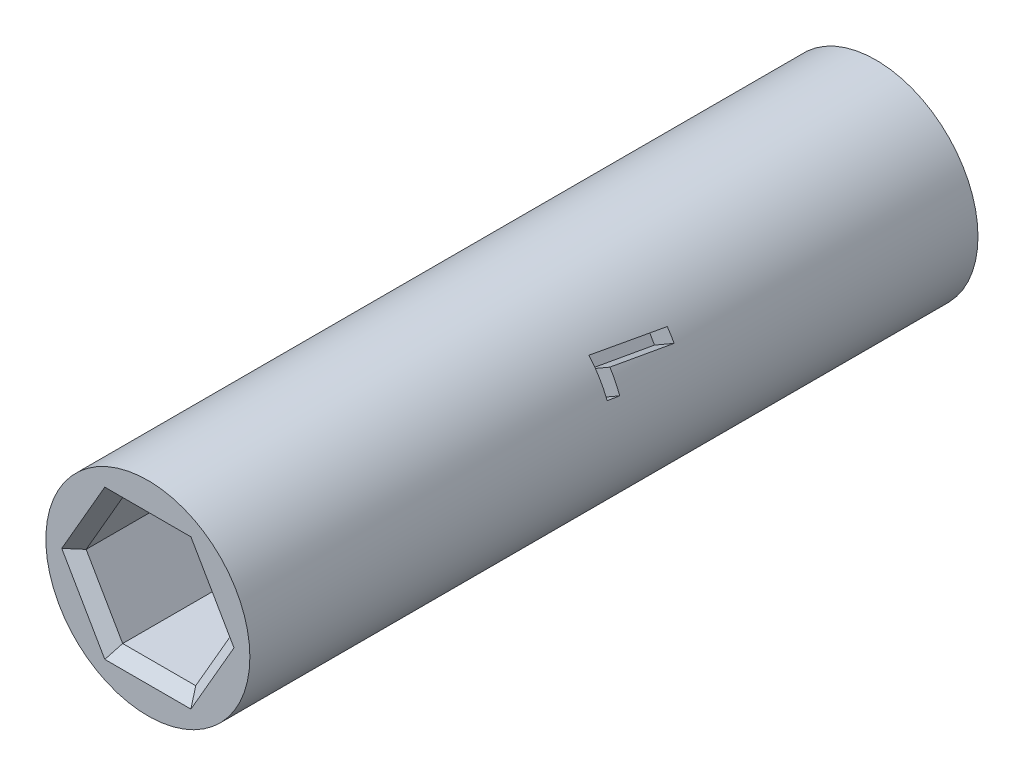
ISO-10303-21;
HEADER;
FILE_DESCRIPTION(('STEP AP214'),'2;1');
FILE_NAME('part.step','',(''),(''),'','','');
FILE_SCHEMA(('AUTOMOTIVE_DESIGN { 1 0 10303 214 1 1 1 1 }'));
ENDSEC;
DATA;
#1=APPLICATION_CONTEXT('core data for automotive mechanical design processes');
#2=APPLICATION_PROTOCOL_DEFINITION('international standard','automotive_design',2000,#1);
#3=PRODUCT_CONTEXT('',#1,'mechanical');
#4=PRODUCT('Part','Part','',(#3));
#5=PRODUCT_RELATED_PRODUCT_CATEGORY('part','',(#4));
#6=PRODUCT_DEFINITION_FORMATION('','',#4);
#7=PRODUCT_DEFINITION_CONTEXT('part definition',#1,'design');
#8=PRODUCT_DEFINITION('design','',#6,#7);
#9=PRODUCT_DEFINITION_SHAPE('','',#8);
#10=(LENGTH_UNIT() NAMED_UNIT(*) SI_UNIT(.MILLI.,.METRE.));
#11=(NAMED_UNIT(*) PLANE_ANGLE_UNIT() SI_UNIT($,.RADIAN.));
#12=(NAMED_UNIT(*) SI_UNIT($,.STERADIAN.) SOLID_ANGLE_UNIT());
#13=UNCERTAINTY_MEASURE_WITH_UNIT(LENGTH_MEASURE(1.E-05),#10,'distance_accuracy_value','');
#14=(GEOMETRIC_REPRESENTATION_CONTEXT(3) GLOBAL_UNCERTAINTY_ASSIGNED_CONTEXT((#13)) GLOBAL_UNIT_ASSIGNED_CONTEXT((#10,
#11,#12)) REPRESENTATION_CONTEXT('',''));
#15=CARTESIAN_POINT('',(0.,0.,0.));
#16=DIRECTION('',(0.,0.,1.));
#17=DIRECTION('',(1.,0.,0.));
#18=AXIS2_PLACEMENT_3D('',#15,#16,#17);
#19=CARTESIAN_POINT('',(0.,0.,0.));
#20=DIRECTION('',(0.,0.,1.));
#21=DIRECTION('',(1.,0.,0.));
#22=AXIS2_PLACEMENT_3D('',#19,#20,#21);
#23=CYLINDRICAL_SURFACE('',#22,4.5);
#24=CARTESIAN_POINT('',(0.,0.,-49.61709914));
#25=DIRECTION('',(0.,0.,1.));
#26=DIRECTION('',(1.,0.,0.));
#27=AXIS2_PLACEMENT_3D('',#24,#25,#26);
#28=CIRCLE('',#27,4.5);
#29=CARTESIAN_POINT('',(4.5,0.,-49.61709914));
#30=VERTEX_POINT('',#29);
#31=EDGE_CURVE('E345',#30,#30,#28,.T.);
#32=ORIENTED_EDGE('',*,*,#31,.T.);
#33=EDGE_LOOP('',(#32));
#34=FACE_BOUND('',#33,.T.);
#35=CARTESIAN_POINT('',(0.,0.,-17.5));
#36=DIRECTION('',(0.,0.,1.));
#37=DIRECTION('',(1.,0.,0.));
#38=AXIS2_PLACEMENT_3D('',#35,#36,#37);
#39=CIRCLE('',#38,4.5);
#40=CARTESIAN_POINT('',(4.5,0.,-17.5));
#41=VERTEX_POINT('',#40);
#42=EDGE_CURVE('E322',#41,#41,#39,.T.);
#43=ORIENTED_EDGE('',*,*,#42,.F.);
#44=EDGE_LOOP('',(#43));
#45=FACE_BOUND('',#44,.T.);
#46=CARTESIAN_POINT('',(0.,0.,-36.73354957));
#47=DIRECTION('',(0.,0.,1.));
#48=DIRECTION('',(1.,0.,0.));
#49=AXIS2_PLACEMENT_3D('',#46,#47,#48);
#50=CIRCLE('',#49,4.5);
#51=CARTESIAN_POINT('',(3.97775975551135,2.10414527241687,-36.73354957));
#52=VERTEX_POINT('',#51);
#53=CARTESIAN_POINT('',(3.67613954755556,2.59538013148325,-36.73354957));
#54=VERTEX_POINT('',#53);
#55=EDGE_CURVE('E57',#52,#54,#50,.T.);
#56=ORIENTED_EDGE('',*,*,#55,.F.);
#57=CARTESIAN_POINT('',(0.,0.,-35.5465489992237));
#58=DIRECTION('',(-0.495144688995939,0.857615758438855,-0.13902139344886));
#59=DIRECTION('',(-0.0695106967244299,0.120396058396224,0.990289377991877));
#60=AXIS2_PLACEMENT_3D('',#57,#58,#59);
#61=ELLIPSE('',#60,32.3691187979307,4.5);
#62=CARTESIAN_POINT('',(3.79067750760948,2.4250286664911,-34.0877162366667));
#63=VERTEX_POINT('',#62);
#64=EDGE_CURVE('E472',#63,#52,#61,.T.);
#65=ORIENTED_EDGE('',*,*,#64,.F.);
#66=CARTESIAN_POINT('',(0.,0.,-34.0877162366667));
#67=DIRECTION('',(0.,0.,1.));
#68=DIRECTION('',(1.,0.,0.));
#69=AXIS2_PLACEMENT_3D('',#66,#67,#68);
#70=CIRCLE('',#69,4.5);
#71=CARTESIAN_POINT('',(4.22582522076293,1.54673889314389,-34.0877162366667));
#72=VERTEX_POINT('',#71);
#73=EDGE_CURVE('E469',#72,#63,#70,.T.);
#74=ORIENTED_EDGE('',*,*,#73,.F.);
#75=CARTESIAN_POINT('',(0.,0.,-28.1296915453087));
#76=DIRECTION('',(-0.495839989793912,0.858820054747488,-0.128727689658036));
#77=DIRECTION('',(-0.0643638448290179,0.111481449414338,0.991679979587823));
#78=AXIS2_PLACEMENT_3D('',#75,#76,#77);
#79=ELLIPSE('',#78,34.9575138958388,4.5);
#80=CARTESIAN_POINT('',(4.20138487407123,1.61194452135472,-33.55854957));
#81=VERTEX_POINT('',#80);
#82=EDGE_CURVE('E465',#81,#72,#79,.T.);
#83=ORIENTED_EDGE('',*,*,#82,.F.);
#84=CARTESIAN_POINT('',(0.,0.,-33.55854957));
#85=DIRECTION('',(0.,0.,-1.));
#86=DIRECTION('',(-1.,0.,0.));
#87=AXIS2_PLACEMENT_3D('',#84,#85,#86);
#88=CIRCLE('',#87,4.5);
#89=CARTESIAN_POINT('',(3.39875321503414,2.94931798612749,-33.55854957));
#90=VERTEX_POINT('',#89);
#91=EDGE_CURVE('E423',#90,#81,#88,.T.);
#92=ORIENTED_EDGE('',*,*,#91,.F.);
#93=CARTESIAN_POINT('',(0.,0.,-39.65454957));
#94=DIRECTION('',(0.495155607363295,-0.857634669605851,0.138865755270155));
#95=DIRECTION('',(-0.0694328776350774,0.120261271779667,0.990311214726588));
#96=AXIS2_PLACEMENT_3D('',#93,#94,#95);
#97=ELLIPSE('',#96,32.4053975095986,4.5);
#98=EDGE_CURVE('E11',#54,#90,#97,.T.);
#99=ORIENTED_EDGE('',*,*,#98,.F.);
#100=EDGE_LOOP('',(#56,#65,#74,#83,#92,#99));
#101=FACE_BOUND('',#100,.T.);
#102=ADVANCED_FACE('F47',(#34,#45,#101),#23,.T.);
#103=CARTESIAN_POINT('',(-4.5,0.,-49.61709914));
#104=DIRECTION('',(0.,0.,-1.));
#105=DIRECTION('',(-1.,0.,0.));
#106=AXIS2_PLACEMENT_3D('',#103,#104,#105);
#107=PLANE('',#106);
#108=DIRECTION('',(-0.5,0.866025403784439,0.));
#109=VECTOR('',#108,1.);
#110=CARTESIAN_POINT('',(2.04381995293128,3.04,-49.61709914));
#111=LINE('',#110,#109);
#112=CARTESIAN_POINT('',(3.79896477126774,0.,-49.61709914));
#113=VERTEX_POINT('',#112);
#114=CARTESIAN_POINT('',(1.89948238563387,3.29,-49.61709914));
#115=VERTEX_POINT('',#114);
#116=EDGE_CURVE('E391',#113,#115,#111,.T.);
#117=ORIENTED_EDGE('',*,*,#116,.T.);
#118=DIRECTION('',(-1.,0.,0.));
#119=VECTOR('',#118,1.);
#120=CARTESIAN_POINT('',(-1.61080725103906,3.29,-49.61709914));
#121=LINE('',#120,#119);
#122=CARTESIAN_POINT('',(-1.89948238563387,3.29,-49.61709914));
#123=VERTEX_POINT('',#122);
#124=EDGE_CURVE('E406',#115,#123,#121,.T.);
#125=ORIENTED_EDGE('',*,*,#124,.T.);
#126=DIRECTION('',(-0.5,-0.866025403784439,0.));
#127=VECTOR('',#126,1.);
#128=CARTESIAN_POINT('',(-3.65462720397033,0.250000000000001,-49.61709914));
#129=LINE('',#128,#127);
#130=CARTESIAN_POINT('',(-3.79896477126774,0.,-49.61709914));
#131=VERTEX_POINT('',#130);
#132=EDGE_CURVE('E403',#123,#131,#129,.T.);
#133=ORIENTED_EDGE('',*,*,#132,.T.);
#134=DIRECTION('',(0.5,-0.866025403784439,0.));
#135=VECTOR('',#134,1.);
#136=CARTESIAN_POINT('',(-2.04381995293128,-3.04,-49.61709914));
#137=LINE('',#136,#135);
#138=CARTESIAN_POINT('',(-1.89948238563387,-3.29,-49.61709914));
#139=VERTEX_POINT('',#138);
#140=EDGE_CURVE('E400',#131,#139,#137,.T.);
#141=ORIENTED_EDGE('',*,*,#140,.T.);
#142=DIRECTION('',(1.,0.,0.));
#143=VECTOR('',#142,1.);
#144=CARTESIAN_POINT('',(1.61080725103905,-3.29,-49.61709914));
#145=LINE('',#144,#143);
#146=CARTESIAN_POINT('',(1.89948238563387,-3.29,-49.61709914));
#147=VERTEX_POINT('',#146);
#148=EDGE_CURVE('E397',#139,#147,#145,.T.);
#149=ORIENTED_EDGE('',*,*,#148,.T.);
#150=DIRECTION('',(0.5,0.866025403784439,0.));
#151=VECTOR('',#150,1.);
#152=CARTESIAN_POINT('',(3.65462720397033,-0.250000000000004,-49.61709914));
#153=LINE('',#152,#151);
#154=EDGE_CURVE('E394',#147,#113,#153,.T.);
#155=ORIENTED_EDGE('',*,*,#154,.T.);
#156=EDGE_LOOP('',(#117,#125,#133,#141,#149,#155));
#157=FACE_BOUND('',#156,.T.);
#158=ORIENTED_EDGE('',*,*,#31,.F.);
#159=EDGE_LOOP('',(#158));
#160=FACE_BOUND('',#159,.T.);
#161=ADVANCED_FACE('F523',(#157,#160),#107,.T.);
#162=CARTESIAN_POINT('',(0.,0.,-17.5));
#163=DIRECTION('',(0.,0.,1.));
#164=DIRECTION('',(1.,0.,0.));
#165=AXIS2_PLACEMENT_3D('',#162,#163,#164);
#166=PLANE('',#165);
#167=DIRECTION('',(1.,0.,0.));
#168=VECTOR('',#167,1.);
#169=CARTESIAN_POINT('',(1.61080725103906,3.29,-17.5));
#170=LINE('',#169,#168);
#171=CARTESIAN_POINT('',(-1.89948238563387,3.29,-17.5));
#172=VERTEX_POINT('',#171);
#173=CARTESIAN_POINT('',(1.89948238563387,3.29,-17.5));
#174=VERTEX_POINT('',#173);
#175=EDGE_CURVE('E353',#172,#174,#170,.T.);
#176=ORIENTED_EDGE('',*,*,#175,.T.);
#177=DIRECTION('',(0.5,-0.866025403784439,0.));
#178=VECTOR('',#177,1.);
#179=CARTESIAN_POINT('',(3.65462720397033,0.250000000000003,-17.5));
#180=LINE('',#179,#178);
#181=CARTESIAN_POINT('',(3.79896477126774,0.,-17.5));
#182=VERTEX_POINT('',#181);
#183=EDGE_CURVE('E368',#174,#182,#180,.T.);
#184=ORIENTED_EDGE('',*,*,#183,.T.);
#185=DIRECTION('',(-0.5,-0.866025403784439,0.));
#186=VECTOR('',#185,1.);
#187=CARTESIAN_POINT('',(2.04381995293128,-3.04,-17.5));
#188=LINE('',#187,#186);
#189=CARTESIAN_POINT('',(1.89948238563387,-3.29,-17.5));
#190=VERTEX_POINT('',#189);
#191=EDGE_CURVE('E365',#182,#190,#188,.T.);
#192=ORIENTED_EDGE('',*,*,#191,.T.);
#193=DIRECTION('',(-1.,0.,0.));
#194=VECTOR('',#193,1.);
#195=CARTESIAN_POINT('',(-1.61080725103905,-3.29,-17.5));
#196=LINE('',#195,#194);
#197=CARTESIAN_POINT('',(-1.89948238563387,-3.29,-17.5));
#198=VERTEX_POINT('',#197);
#199=EDGE_CURVE('E362',#190,#198,#196,.T.);
#200=ORIENTED_EDGE('',*,*,#199,.T.);
#201=DIRECTION('',(-0.5,0.866025403784439,0.));
#202=VECTOR('',#201,1.);
#203=CARTESIAN_POINT('',(-3.65462720397033,-0.250000000000003,-17.5));
#204=LINE('',#203,#202);
#205=CARTESIAN_POINT('',(-3.79896477126774,0.,-17.5));
#206=VERTEX_POINT('',#205);
#207=EDGE_CURVE('E359',#198,#206,#204,.T.);
#208=ORIENTED_EDGE('',*,*,#207,.T.);
#209=DIRECTION('',(0.5,0.866025403784439,0.));
#210=VECTOR('',#209,1.);
#211=CARTESIAN_POINT('',(-2.04381995293128,3.04,-17.5));
#212=LINE('',#211,#210);
#213=EDGE_CURVE('E356',#206,#172,#212,.T.);
#214=ORIENTED_EDGE('',*,*,#213,.T.);
#215=EDGE_LOOP('',(#176,#184,#192,#200,#208,#214));
#216=FACE_BOUND('',#215,.T.);
#217=ORIENTED_EDGE('',*,*,#42,.T.);
#218=EDGE_LOOP('',(#217));
#219=FACE_BOUND('',#218,.T.);
#220=ADVANCED_FACE('F531',(#216,#219),#166,.T.);
#221=CARTESIAN_POINT('',(3.22161450207811,0.,-24.5));
#222=DIRECTION('',(0.866025403784438,0.5,0.));
#223=DIRECTION('',(-0.5,0.866025403784439,0.));
#224=AXIS2_PLACEMENT_3D('',#221,#222,#223);
#225=PLANE('',#224);
#226=DIRECTION('',(0.,0.,1.));
#227=VECTOR('',#226,1.);
#228=CARTESIAN_POINT('',(3.22161450207811,0.,-24.5));
#229=LINE('',#228,#227);
#230=CARTESIAN_POINT('',(3.22161450207811,0.,-24.5));
#231=VERTEX_POINT('',#230);
#232=CARTESIAN_POINT('',(3.22161450207811,0.,-18.));
#233=VERTEX_POINT('',#232);
#234=EDGE_CURVE('E318',#231,#233,#229,.T.);
#235=ORIENTED_EDGE('',*,*,#234,.T.);
#236=DIRECTION('',(-0.5,0.866025403784439,0.));
#237=VECTOR('',#236,1.);
#238=CARTESIAN_POINT('',(1.61080725103906,2.79,-18.));
#239=LINE('',#238,#237);
#240=CARTESIAN_POINT('',(1.61080725103906,2.79,-18.));
#241=VERTEX_POINT('',#240);
#242=EDGE_CURVE('E349',#233,#241,#239,.T.);
#243=ORIENTED_EDGE('',*,*,#242,.T.);
#244=DIRECTION('',(0.,0.,1.));
#245=VECTOR('',#244,1.);
#246=CARTESIAN_POINT('',(1.61080725103906,2.79,-24.5));
#247=LINE('',#246,#245);
#248=CARTESIAN_POINT('',(1.61080725103906,2.79,-24.5));
#249=VERTEX_POINT('',#248);
#250=EDGE_CURVE('E317',#249,#241,#247,.T.);
#251=ORIENTED_EDGE('',*,*,#250,.F.);
#252=DIRECTION('',(-0.5,0.866025403784438,0.));
#253=VECTOR('',#252,1.);
#254=CARTESIAN_POINT('',(3.22161450207811,0.,-24.5));
#255=LINE('',#254,#253);
#256=EDGE_CURVE('E277',#231,#249,#255,.T.);
#257=ORIENTED_EDGE('',*,*,#256,.F.);
#258=EDGE_LOOP('',(#235,#243,#251,#257));
#259=FACE_BOUND('',#258,.T.);
#260=ADVANCED_FACE('F669',(#259),#225,.F.);
#261=CARTESIAN_POINT('',(1.61080725103906,-2.79,-24.5));
#262=DIRECTION('',(0.866025403784439,-0.5,0.));
#263=DIRECTION('',(0.5,0.866025403784439,0.));
#264=AXIS2_PLACEMENT_3D('',#261,#262,#263);
#265=PLANE('',#264);
#266=DIRECTION('',(0.,0.,1.));
#267=VECTOR('',#266,1.);
#268=CARTESIAN_POINT('',(1.61080725103906,-2.79,-24.5));
#269=LINE('',#268,#267);
#270=CARTESIAN_POINT('',(1.61080725103906,-2.79,-24.5));
#271=VERTEX_POINT('',#270);
#272=CARTESIAN_POINT('',(1.61080725103906,-2.79,-18.));
#273=VERTEX_POINT('',#272);
#274=EDGE_CURVE('E323',#271,#273,#269,.T.);
#275=ORIENTED_EDGE('',*,*,#274,.T.);
#276=DIRECTION('',(0.5,0.866025403784439,0.));
#277=VECTOR('',#276,1.);
#278=CARTESIAN_POINT('',(3.22161450207811,0.,-18.));
#279=LINE('',#278,#277);
#280=EDGE_CURVE('E372',#273,#233,#279,.T.);
#281=ORIENTED_EDGE('',*,*,#280,.T.);
#282=ORIENTED_EDGE('',*,*,#234,.F.);
#283=DIRECTION('',(0.5,0.866025403784439,0.));
#284=VECTOR('',#283,1.);
#285=CARTESIAN_POINT('',(1.61080725103906,-2.79,-24.5));
#286=LINE('',#285,#284);
#287=EDGE_CURVE('E313',#271,#231,#286,.T.);
#288=ORIENTED_EDGE('',*,*,#287,.F.);
#289=EDGE_LOOP('',(#275,#281,#282,#288));
#290=FACE_BOUND('',#289,.T.);
#291=ADVANCED_FACE('F665',(#290),#265,.F.);
#292=CARTESIAN_POINT('',(-1.61080725103905,-2.79,-24.5));
#293=DIRECTION('',(0.,-1.,0.));
#294=DIRECTION('',(1.,0.,0.));
#295=AXIS2_PLACEMENT_3D('',#292,#293,#294);
#296=PLANE('',#295);
#297=DIRECTION('',(0.,0.,1.));
#298=VECTOR('',#297,1.);
#299=CARTESIAN_POINT('',(-1.61080725103905,-2.79,-24.5));
#300=LINE('',#299,#298);
#301=CARTESIAN_POINT('',(-1.61080725103905,-2.79,-24.5));
#302=VERTEX_POINT('',#301);
#303=CARTESIAN_POINT('',(-1.61080725103905,-2.79,-18.));
#304=VERTEX_POINT('',#303);
#305=EDGE_CURVE('E327',#302,#304,#300,.T.);
#306=ORIENTED_EDGE('',*,*,#305,.T.);
#307=DIRECTION('',(1.,0.,0.));
#308=VECTOR('',#307,1.);
#309=CARTESIAN_POINT('',(1.61080725103906,-2.79,-18.));
#310=LINE('',#309,#308);
#311=EDGE_CURVE('E375',#304,#273,#310,.T.);
#312=ORIENTED_EDGE('',*,*,#311,.T.);
#313=ORIENTED_EDGE('',*,*,#274,.F.);
#314=DIRECTION('',(1.,0.,0.));
#315=VECTOR('',#314,1.);
#316=CARTESIAN_POINT('',(-1.61080725103905,-2.79,-24.5));
#317=LINE('',#316,#315);
#318=EDGE_CURVE('E309',#302,#271,#317,.T.);
#319=ORIENTED_EDGE('',*,*,#318,.F.);
#320=EDGE_LOOP('',(#306,#312,#313,#319));
#321=FACE_BOUND('',#320,.T.);
#322=ADVANCED_FACE('F668',(#321),#296,.F.);
#323=CARTESIAN_POINT('',(-3.22161450207811,0.,-24.5));
#324=DIRECTION('',(-0.866025403784438,-0.5,0.));
#325=DIRECTION('',(0.5,-0.866025403784439,0.));
#326=AXIS2_PLACEMENT_3D('',#323,#324,#325);
#327=PLANE('',#326);
#328=DIRECTION('',(0.,0.,1.));
#329=VECTOR('',#328,1.);
#330=CARTESIAN_POINT('',(-3.22161450207811,0.,-24.5));
#331=LINE('',#330,#329);
#332=CARTESIAN_POINT('',(-3.22161450207811,0.,-24.5));
#333=VERTEX_POINT('',#332);
#334=CARTESIAN_POINT('',(-3.22161450207811,0.,-18.));
#335=VERTEX_POINT('',#334);
#336=EDGE_CURVE('E331',#333,#335,#331,.T.);
#337=ORIENTED_EDGE('',*,*,#336,.T.);
#338=DIRECTION('',(0.5,-0.866025403784439,0.));
#339=VECTOR('',#338,1.);
#340=CARTESIAN_POINT('',(-1.61080725103905,-2.79,-18.));
#341=LINE('',#340,#339);
#342=EDGE_CURVE('E378',#335,#304,#341,.T.);
#343=ORIENTED_EDGE('',*,*,#342,.T.);
#344=ORIENTED_EDGE('',*,*,#305,.F.);
#345=DIRECTION('',(0.5,-0.866025403784439,0.));
#346=VECTOR('',#345,1.);
#347=CARTESIAN_POINT('',(-3.22161450207811,0.,-24.5));
#348=LINE('',#347,#346);
#349=EDGE_CURVE('E305',#333,#302,#348,.T.);
#350=ORIENTED_EDGE('',*,*,#349,.F.);
#351=EDGE_LOOP('',(#337,#343,#344,#350));
#352=FACE_BOUND('',#351,.T.);
#353=ADVANCED_FACE('F673',(#352),#327,.F.);
#354=CARTESIAN_POINT('',(-1.61080725103906,2.79,-24.5));
#355=DIRECTION('',(-0.866025403784439,0.5,0.));
#356=DIRECTION('',(-0.5,-0.866025403784439,0.));
#357=AXIS2_PLACEMENT_3D('',#354,#355,#356);
#358=PLANE('',#357);
#359=DIRECTION('',(0.,0.,1.));
#360=VECTOR('',#359,1.);
#361=CARTESIAN_POINT('',(-1.61080725103906,2.79,-24.5));
#362=LINE('',#361,#360);
#363=CARTESIAN_POINT('',(-1.61080725103906,2.79,-24.5));
#364=VERTEX_POINT('',#363);
#365=CARTESIAN_POINT('',(-1.61080725103906,2.79,-18.));
#366=VERTEX_POINT('',#365);
#367=EDGE_CURVE('E335',#364,#366,#362,.T.);
#368=ORIENTED_EDGE('',*,*,#367,.T.);
#369=DIRECTION('',(-0.5,-0.866025403784439,0.));
#370=VECTOR('',#369,1.);
#371=CARTESIAN_POINT('',(-3.22161450207811,0.,-18.));
#372=LINE('',#371,#370);
#373=EDGE_CURVE('E381',#366,#335,#372,.T.);
#374=ORIENTED_EDGE('',*,*,#373,.T.);
#375=ORIENTED_EDGE('',*,*,#336,.F.);
#376=DIRECTION('',(-0.5,-0.866025403784439,0.));
#377=VECTOR('',#376,1.);
#378=CARTESIAN_POINT('',(-1.61080725103906,2.79,-24.5));
#379=LINE('',#378,#377);
#380=EDGE_CURVE('E301',#364,#333,#379,.T.);
#381=ORIENTED_EDGE('',*,*,#380,.F.);
#382=EDGE_LOOP('',(#368,#374,#375,#381));
#383=FACE_BOUND('',#382,.T.);
#384=ADVANCED_FACE('F677',(#383),#358,.F.);
#385=CARTESIAN_POINT('',(1.61080725103906,2.79,-24.5));
#386=DIRECTION('',(0.,1.,0.));
#387=DIRECTION('',(0.,0.,1.));
#388=AXIS2_PLACEMENT_3D('',#385,#386,#387);
#389=PLANE('',#388);
#390=ORIENTED_EDGE('',*,*,#250,.T.);
#391=DIRECTION('',(-1.,0.,0.));
#392=VECTOR('',#391,1.);
#393=CARTESIAN_POINT('',(-1.61080725103906,2.79,-18.));
#394=LINE('',#393,#392);
#395=EDGE_CURVE('E384',#241,#366,#394,.T.);
#396=ORIENTED_EDGE('',*,*,#395,.T.);
#397=ORIENTED_EDGE('',*,*,#367,.F.);
#398=DIRECTION('',(-1.,0.,0.));
#399=VECTOR('',#398,1.);
#400=CARTESIAN_POINT('',(1.61080725103906,2.79,-24.5));
#401=LINE('',#400,#399);
#402=EDGE_CURVE('E297',#249,#364,#401,.T.);
#403=ORIENTED_EDGE('',*,*,#402,.F.);
#404=EDGE_LOOP('',(#390,#396,#397,#403));
#405=FACE_BOUND('',#404,.T.);
#406=ADVANCED_FACE('F663',(#405),#389,.F.);
#407=CARTESIAN_POINT('',(0.,0.,-24.5));
#408=DIRECTION('',(0.,0.,1.));
#409=DIRECTION('',(1.,0.,0.));
#410=AXIS2_PLACEMENT_3D('',#407,#408,#409);
#411=PLANE('',#410);
#412=ORIENTED_EDGE('',*,*,#256,.T.);
#413=ORIENTED_EDGE('',*,*,#402,.T.);
#414=ORIENTED_EDGE('',*,*,#380,.T.);
#415=ORIENTED_EDGE('',*,*,#349,.T.);
#416=ORIENTED_EDGE('',*,*,#318,.T.);
#417=ORIENTED_EDGE('',*,*,#287,.T.);
#418=EDGE_LOOP('',(#412,#413,#414,#415,#416,#417));
#419=FACE_BOUND('',#418,.T.);
#420=ADVANCED_FACE('F660',(#419),#411,.T.);
#421=CARTESIAN_POINT('',(-3.22161450207811,0.,-42.61709914));
#422=DIRECTION('',(-0.866025403784439,0.5,0.));
#423=DIRECTION('',(-0.5,-0.866025403784439,0.));
#424=AXIS2_PLACEMENT_3D('',#421,#422,#423);
#425=PLANE('',#424);
#426=DIRECTION('',(0.,0.,-1.));
#427=VECTOR('',#426,1.);
#428=CARTESIAN_POINT('',(-3.22161450207811,0.,-42.61709914));
#429=LINE('',#428,#427);
#430=CARTESIAN_POINT('',(-3.22161450207811,0.,-42.61709914));
#431=VERTEX_POINT('',#430);
#432=CARTESIAN_POINT('',(-3.22161450207811,0.,-49.11709914));
#433=VERTEX_POINT('',#432);
#434=EDGE_CURVE('E273',#431,#433,#429,.T.);
#435=ORIENTED_EDGE('',*,*,#434,.T.);
#436=DIRECTION('',(0.5,0.866025403784439,0.));
#437=VECTOR('',#436,1.);
#438=CARTESIAN_POINT('',(-1.61080725103906,2.79,-49.11709914));
#439=LINE('',#438,#437);
#440=CARTESIAN_POINT('',(-1.61080725103906,2.79,-49.11709914));
#441=VERTEX_POINT('',#440);
#442=EDGE_CURVE('E410',#433,#441,#439,.T.);
#443=ORIENTED_EDGE('',*,*,#442,.T.);
#444=DIRECTION('',(0.,0.,-1.));
#445=VECTOR('',#444,1.);
#446=CARTESIAN_POINT('',(-1.61080725103906,2.79,-42.61709914));
#447=LINE('',#446,#445);
#448=CARTESIAN_POINT('',(-1.61080725103906,2.79,-42.61709914));
#449=VERTEX_POINT('',#448);
#450=EDGE_CURVE('E272',#449,#441,#447,.T.);
#451=ORIENTED_EDGE('',*,*,#450,.F.);
#452=DIRECTION('',(0.5,0.866025403784439,0.));
#453=VECTOR('',#452,1.);
#454=CARTESIAN_POINT('',(-3.22161450207811,0.,-42.61709914));
#455=LINE('',#454,#453);
#456=EDGE_CURVE('E247',#431,#449,#455,.T.);
#457=ORIENTED_EDGE('',*,*,#456,.F.);
#458=EDGE_LOOP('',(#435,#443,#451,#457));
#459=FACE_BOUND('',#458,.T.);
#460=ADVANCED_FACE('F632',(#459),#425,.F.);
#461=CARTESIAN_POINT('',(-1.61080725103906,-2.79,-42.61709914));
#462=DIRECTION('',(-0.866025403784439,-0.5,0.));
#463=DIRECTION('',(0.5,-0.866025403784439,0.));
#464=AXIS2_PLACEMENT_3D('',#461,#462,#463);
#465=PLANE('',#464);
#466=DIRECTION('',(0.,0.,-1.));
#467=VECTOR('',#466,1.);
#468=CARTESIAN_POINT('',(-1.61080725103906,-2.79,-42.61709914));
#469=LINE('',#468,#467);
#470=CARTESIAN_POINT('',(-1.61080725103906,-2.79,-42.61709914));
#471=VERTEX_POINT('',#470);
#472=CARTESIAN_POINT('',(-1.61080725103906,-2.79,-49.11709914));
#473=VERTEX_POINT('',#472);
#474=EDGE_CURVE('E278',#471,#473,#469,.T.);
#475=ORIENTED_EDGE('',*,*,#474,.T.);
#476=DIRECTION('',(-0.5,0.866025403784439,0.));
#477=VECTOR('',#476,1.);
#478=CARTESIAN_POINT('',(-3.22161450207811,0.,-49.11709914));
#479=LINE('',#478,#477);
#480=EDGE_CURVE('E413',#473,#433,#479,.T.);
#481=ORIENTED_EDGE('',*,*,#480,.T.);
#482=ORIENTED_EDGE('',*,*,#434,.F.);
#483=DIRECTION('',(-0.5,0.866025403784439,0.));
#484=VECTOR('',#483,1.);
#485=CARTESIAN_POINT('',(-1.61080725103906,-2.79,-42.61709914));
#486=LINE('',#485,#484);
#487=EDGE_CURVE('E268',#471,#431,#486,.T.);
#488=ORIENTED_EDGE('',*,*,#487,.F.);
#489=EDGE_LOOP('',(#475,#481,#482,#488));
#490=FACE_BOUND('',#489,.T.);
#491=ADVANCED_FACE('F642',(#490),#465,.F.);
#492=CARTESIAN_POINT('',(1.61080725103905,-2.79,-42.61709914));
#493=DIRECTION('',(0.,-1.,0.));
#494=DIRECTION('',(1.,0.,0.));
#495=AXIS2_PLACEMENT_3D('',#492,#493,#494);
#496=PLANE('',#495);
#497=DIRECTION('',(0.,0.,-1.));
#498=VECTOR('',#497,1.);
#499=CARTESIAN_POINT('',(1.61080725103905,-2.79,-42.61709914));
#500=LINE('',#499,#498);
#501=CARTESIAN_POINT('',(1.61080725103905,-2.79,-42.61709914));
#502=VERTEX_POINT('',#501);
#503=CARTESIAN_POINT('',(1.61080725103905,-2.79,-49.11709914));
#504=VERTEX_POINT('',#503);
#505=EDGE_CURVE('E282',#502,#504,#500,.T.);
#506=ORIENTED_EDGE('',*,*,#505,.T.);
#507=DIRECTION('',(-1.,0.,0.));
#508=VECTOR('',#507,1.);
#509=CARTESIAN_POINT('',(-1.61080725103906,-2.79,-49.11709914));
#510=LINE('',#509,#508);
#511=EDGE_CURVE('E416',#504,#473,#510,.T.);
#512=ORIENTED_EDGE('',*,*,#511,.T.);
#513=ORIENTED_EDGE('',*,*,#474,.F.);
#514=DIRECTION('',(-1.,0.,0.));
#515=VECTOR('',#514,1.);
#516=CARTESIAN_POINT('',(1.61080725103905,-2.79,-42.61709914));
#517=LINE('',#516,#515);
#518=EDGE_CURVE('E264',#502,#471,#517,.T.);
#519=ORIENTED_EDGE('',*,*,#518,.F.);
#520=EDGE_LOOP('',(#506,#512,#513,#519));
#521=FACE_BOUND('',#520,.T.);
#522=ADVANCED_FACE('F644',(#521),#496,.F.);
#523=CARTESIAN_POINT('',(3.22161450207811,0.,-42.61709914));
#524=DIRECTION('',(0.866025403784438,-0.5,0.));
#525=DIRECTION('',(0.5,0.866025403784438,0.));
#526=AXIS2_PLACEMENT_3D('',#523,#524,#525);
#527=PLANE('',#526);
#528=DIRECTION('',(0.,0.,-1.));
#529=VECTOR('',#528,1.);
#530=CARTESIAN_POINT('',(3.22161450207811,0.,-42.61709914));
#531=LINE('',#530,#529);
#532=CARTESIAN_POINT('',(3.22161450207811,0.,-42.61709914));
#533=VERTEX_POINT('',#532);
#534=CARTESIAN_POINT('',(3.22161450207811,0.,-49.11709914));
#535=VERTEX_POINT('',#534);
#536=EDGE_CURVE('E285',#533,#535,#531,.T.);
#537=ORIENTED_EDGE('',*,*,#536,.T.);
#538=DIRECTION('',(-0.5,-0.866025403784438,0.));
#539=VECTOR('',#538,1.);
#540=CARTESIAN_POINT('',(1.61080725103905,-2.79,-49.11709914));
#541=LINE('',#540,#539);
#542=EDGE_CURVE('E71',#535,#504,#541,.T.);
#543=ORIENTED_EDGE('',*,*,#542,.T.);
#544=ORIENTED_EDGE('',*,*,#505,.F.);
#545=DIRECTION('',(-0.5,-0.866025403784438,0.));
#546=VECTOR('',#545,1.);
#547=CARTESIAN_POINT('',(3.22161450207811,0.,-42.61709914));
#548=LINE('',#547,#546);
#549=EDGE_CURVE('E260',#533,#502,#548,.T.);
#550=ORIENTED_EDGE('',*,*,#549,.F.);
#551=EDGE_LOOP('',(#537,#543,#544,#550));
#552=FACE_BOUND('',#551,.T.);
#553=ADVANCED_FACE('F646',(#552),#527,.F.);
#554=CARTESIAN_POINT('',(1.61080725103906,2.79,-42.61709914));
#555=DIRECTION('',(0.866025403784439,0.5,0.));
#556=DIRECTION('',(-0.5,0.866025403784439,0.));
#557=AXIS2_PLACEMENT_3D('',#554,#555,#556);
#558=PLANE('',#557);
#559=DIRECTION('',(0.,0.,-1.));
#560=VECTOR('',#559,1.);
#561=CARTESIAN_POINT('',(1.61080725103906,2.79,-42.61709914));
#562=LINE('',#561,#560);
#563=CARTESIAN_POINT('',(1.61080725103906,2.79,-42.61709914));
#564=VERTEX_POINT('',#563);
#565=CARTESIAN_POINT('',(1.61080725103906,2.79,-49.11709914));
#566=VERTEX_POINT('',#565);
#567=EDGE_CURVE('E288',#564,#566,#562,.T.);
#568=ORIENTED_EDGE('',*,*,#567,.T.);
#569=DIRECTION('',(0.5,-0.866025403784439,0.));
#570=VECTOR('',#569,1.);
#571=CARTESIAN_POINT('',(3.22161450207811,0.,-49.11709914));
#572=LINE('',#571,#570);
#573=EDGE_CURVE('E64',#566,#535,#572,.T.);
#574=ORIENTED_EDGE('',*,*,#573,.T.);
#575=ORIENTED_EDGE('',*,*,#536,.F.);
#576=DIRECTION('',(0.5,-0.866025403784439,0.));
#577=VECTOR('',#576,1.);
#578=CARTESIAN_POINT('',(1.61080725103906,2.79,-42.61709914));
#579=LINE('',#578,#577);
#580=EDGE_CURVE('E256',#564,#533,#579,.T.);
#581=ORIENTED_EDGE('',*,*,#580,.F.);
#582=EDGE_LOOP('',(#568,#574,#575,#581));
#583=FACE_BOUND('',#582,.T.);
#584=ADVANCED_FACE('F647',(#583),#558,.F.);
#585=CARTESIAN_POINT('',(-1.61080725103906,2.79,-42.61709914));
#586=DIRECTION('',(0.,1.,0.));
#587=DIRECTION('',(0.,0.,1.));
#588=AXIS2_PLACEMENT_3D('',#585,#586,#587);
#589=PLANE('',#588);
#590=ORIENTED_EDGE('',*,*,#450,.T.);
#591=DIRECTION('',(1.,0.,0.));
#592=VECTOR('',#591,1.);
#593=CARTESIAN_POINT('',(1.61080725103906,2.79,-49.11709914));
#594=LINE('',#593,#592);
#595=EDGE_CURVE('E387',#441,#566,#594,.T.);
#596=ORIENTED_EDGE('',*,*,#595,.T.);
#597=ORIENTED_EDGE('',*,*,#567,.F.);
#598=DIRECTION('',(1.,0.,0.));
#599=VECTOR('',#598,1.);
#600=CARTESIAN_POINT('',(-1.61080725103906,2.79,-42.61709914));
#601=LINE('',#600,#599);
#602=EDGE_CURVE('E251',#449,#564,#601,.T.);
#603=ORIENTED_EDGE('',*,*,#602,.F.);
#604=EDGE_LOOP('',(#590,#596,#597,#603));
#605=FACE_BOUND('',#604,.T.);
#606=ADVANCED_FACE('F636',(#605),#589,.F.);
#607=CARTESIAN_POINT('',(0.,0.,-42.61709914));
#608=DIRECTION('',(0.,0.,-1.));
#609=DIRECTION('',(-1.,0.,0.));
#610=AXIS2_PLACEMENT_3D('',#607,#608,#609);
#611=PLANE('',#610);
#612=ORIENTED_EDGE('',*,*,#456,.T.);
#613=ORIENTED_EDGE('',*,*,#602,.T.);
#614=ORIENTED_EDGE('',*,*,#580,.T.);
#615=ORIENTED_EDGE('',*,*,#549,.T.);
#616=ORIENTED_EDGE('',*,*,#518,.T.);
#617=ORIENTED_EDGE('',*,*,#487,.T.);
#618=EDGE_LOOP('',(#612,#613,#614,#615,#616,#617));
#619=FACE_BOUND('',#618,.T.);
#620=ADVANCED_FACE('F578',(#619),#611,.T.);
#621=CARTESIAN_POINT('',(-3.22161450207811,0.,-18.));
#622=DIRECTION('',(0.612372435695793,0.353553390593273,0.70710678118655));
#623=DIRECTION('',(-0.5,0.866025403784439,0.));
#624=AXIS2_PLACEMENT_3D('',#621,#622,#623);
#625=PLANE('',#624);
#626=DIRECTION('',(0.755928946018457,0.,-0.654653670707974));
#627=VECTOR('',#626,1.);
#628=CARTESIAN_POINT('',(-3.22161450207811,0.,-18.));
#629=LINE('',#628,#627);
#630=EDGE_CURVE('E439',#206,#335,#629,.T.);
#631=ORIENTED_EDGE('',*,*,#630,.F.);
#632=ORIENTED_EDGE('',*,*,#207,.F.);
#633=DIRECTION('',(0.377964473009228,0.654653670707979,-0.654653670707975));
#634=VECTOR('',#633,1.);
#635=CARTESIAN_POINT('',(-1.61080725103905,-2.79,-18.));
#636=LINE('',#635,#634);
#637=EDGE_CURVE('E252',#304,#198,#636,.F.);
#638=ORIENTED_EDGE('',*,*,#637,.F.);
#639=ORIENTED_EDGE('',*,*,#342,.F.);
#640=EDGE_LOOP('',(#631,#632,#638,#639));
#641=FACE_BOUND('',#640,.T.);
#642=ADVANCED_FACE('F572',(#641),#625,.T.);
#643=CARTESIAN_POINT('',(-1.61080725103905,-2.79,-18.));
#644=DIRECTION('',(0.,0.707106781186545,0.70710678118655));
#645=DIRECTION('',(-1.,0.,0.));
#646=AXIS2_PLACEMENT_3D('',#643,#644,#645);
#647=PLANE('',#646);
#648=ORIENTED_EDGE('',*,*,#637,.T.);
#649=ORIENTED_EDGE('',*,*,#199,.F.);
#650=DIRECTION('',(-0.377964473009229,0.654653670707979,-0.654653670707974));
#651=VECTOR('',#650,1.);
#652=CARTESIAN_POINT('',(1.61080725103906,-2.79,-18.));
#653=LINE('',#652,#651);
#654=EDGE_CURVE('E435',#273,#190,#653,.F.);
#655=ORIENTED_EDGE('',*,*,#654,.F.);
#656=ORIENTED_EDGE('',*,*,#311,.F.);
#657=EDGE_LOOP('',(#648,#649,#655,#656));
#658=FACE_BOUND('',#657,.T.);
#659=ADVANCED_FACE('F565',(#658),#647,.T.);
#660=CARTESIAN_POINT('',(-1.61080725103906,2.79,-18.));
#661=DIRECTION('',(0.612372435695792,-0.353553390593272,0.707106781186551));
#662=DIRECTION('',(0.5,0.866025403784439,0.));
#663=AXIS2_PLACEMENT_3D('',#660,#661,#662);
#664=PLANE('',#663);
#665=ORIENTED_EDGE('',*,*,#630,.T.);
#666=ORIENTED_EDGE('',*,*,#373,.F.);
#667=DIRECTION('',(0.37796447300923,-0.654653670707979,-0.654653670707974));
#668=VECTOR('',#667,1.);
#669=CARTESIAN_POINT('',(-1.61080725103906,2.79,-18.));
#670=LINE('',#669,#668);
#671=EDGE_CURVE('E431',#172,#366,#670,.T.);
#672=ORIENTED_EDGE('',*,*,#671,.F.);
#673=ORIENTED_EDGE('',*,*,#213,.F.);
#674=EDGE_LOOP('',(#665,#666,#672,#673));
#675=FACE_BOUND('',#674,.T.);
#676=ADVANCED_FACE('F558',(#675),#664,.T.);
#677=CARTESIAN_POINT('',(1.61080725103906,-2.79,-18.));
#678=DIRECTION('',(-0.612372435695792,0.353553390593272,0.70710678118655));
#679=DIRECTION('',(-0.5,-0.866025403784439,0.));
#680=AXIS2_PLACEMENT_3D('',#677,#678,#679);
#681=PLANE('',#680);
#682=ORIENTED_EDGE('',*,*,#654,.T.);
#683=ORIENTED_EDGE('',*,*,#191,.F.);
#684=DIRECTION('',(-0.755928946018457,0.,-0.654653670707975));
#685=VECTOR('',#684,1.);
#686=CARTESIAN_POINT('',(3.22161450207811,0.,-18.));
#687=LINE('',#686,#685);
#688=EDGE_CURVE('E427',#233,#182,#687,.F.);
#689=ORIENTED_EDGE('',*,*,#688,.F.);
#690=ORIENTED_EDGE('',*,*,#280,.F.);
#691=EDGE_LOOP('',(#682,#683,#689,#690));
#692=FACE_BOUND('',#691,.T.);
#693=ADVANCED_FACE('F551',(#692),#681,.T.);
#694=CARTESIAN_POINT('',(1.61080725103906,2.79,-18.));
#695=DIRECTION('',(0.,-0.707106781186545,0.70710678118655));
#696=DIRECTION('',(1.,0.,0.));
#697=AXIS2_PLACEMENT_3D('',#694,#695,#696);
#698=PLANE('',#697);
#699=ORIENTED_EDGE('',*,*,#671,.T.);
#700=ORIENTED_EDGE('',*,*,#395,.F.);
#701=DIRECTION('',(0.377964473009228,0.654653670707979,0.654653670707975));
#702=VECTOR('',#701,1.);
#703=CARTESIAN_POINT('',(1.15057660788504,1.99285714285714,-18.7971428571429));
#704=LINE('',#703,#702);
#705=EDGE_CURVE('E424',#174,#241,#704,.F.);
#706=ORIENTED_EDGE('',*,*,#705,.F.);
#707=ORIENTED_EDGE('',*,*,#175,.F.);
#708=EDGE_LOOP('',(#699,#700,#706,#707));
#709=FACE_BOUND('',#708,.T.);
#710=ADVANCED_FACE('F544',(#709),#698,.T.);
#711=CARTESIAN_POINT('',(3.22161450207811,0.,-18.));
#712=DIRECTION('',(-0.612372435695792,-0.353553390593273,0.70710678118655));
#713=DIRECTION('',(0.5,-0.866025403784439,0.));
#714=AXIS2_PLACEMENT_3D('',#711,#712,#713);
#715=PLANE('',#714);
#716=ORIENTED_EDGE('',*,*,#688,.T.);
#717=ORIENTED_EDGE('',*,*,#183,.F.);
#718=ORIENTED_EDGE('',*,*,#705,.T.);
#719=ORIENTED_EDGE('',*,*,#242,.F.);
#720=EDGE_LOOP('',(#716,#717,#718,#719));
#721=FACE_BOUND('',#720,.T.);
#722=ADVANCED_FACE('F538',(#721),#715,.T.);
#723=CARTESIAN_POINT('',(1.61080725103905,-2.79,-49.11709914));
#724=DIRECTION('',(0.,0.707106781186546,-0.707106781186549));
#725=DIRECTION('',(1.,0.,0.));
#726=AXIS2_PLACEMENT_3D('',#723,#724,#725);
#727=PLANE('',#726);
#728=DIRECTION('',(-0.377964473009229,0.654653670707978,0.654653670707976));
#729=VECTOR('',#728,1.);
#730=CARTESIAN_POINT('',(1.61080725103905,-2.79,-49.11709914));
#731=LINE('',#730,#729);
#732=EDGE_CURVE('E456',#147,#504,#731,.T.);
#733=ORIENTED_EDGE('',*,*,#732,.F.);
#734=ORIENTED_EDGE('',*,*,#148,.F.);
#735=DIRECTION('',(0.377964473009227,0.654653670707978,0.654653670707976));
#736=VECTOR('',#735,1.);
#737=CARTESIAN_POINT('',(-1.61080725103906,-2.79,-49.11709914));
#738=LINE('',#737,#736);
#739=EDGE_CURVE('E428',#473,#139,#738,.F.);
#740=ORIENTED_EDGE('',*,*,#739,.F.);
#741=ORIENTED_EDGE('',*,*,#511,.F.);
#742=EDGE_LOOP('',(#733,#734,#740,#741));
#743=FACE_BOUND('',#742,.T.);
#744=ADVANCED_FACE('F50',(#743),#727,.T.);
#745=CARTESIAN_POINT('',(-1.61080725103906,-2.79,-49.11709914));
#746=DIRECTION('',(0.612372435695794,0.353553390593273,-0.707106781186548));
#747=DIRECTION('',(0.5,-0.866025403784439,0.));
#748=AXIS2_PLACEMENT_3D('',#745,#746,#747);
#749=PLANE('',#748);
#750=ORIENTED_EDGE('',*,*,#739,.T.);
#751=ORIENTED_EDGE('',*,*,#140,.F.);
#752=DIRECTION('',(0.755928946018455,0.,0.654653670707976));
#753=VECTOR('',#752,1.);
#754=CARTESIAN_POINT('',(-3.22161450207811,0.,-49.11709914));
#755=LINE('',#754,#753);
#756=EDGE_CURVE('E452',#433,#131,#755,.F.);
#757=ORIENTED_EDGE('',*,*,#756,.F.);
#758=ORIENTED_EDGE('',*,*,#480,.F.);
#759=EDGE_LOOP('',(#750,#751,#757,#758));
#760=FACE_BOUND('',#759,.T.);
#761=ADVANCED_FACE('F606',(#760),#749,.T.);
#762=CARTESIAN_POINT('',(3.22161450207811,0.,-49.11709914));
#763=DIRECTION('',(-0.612372435695793,0.353553390593273,-0.707106781186549));
#764=DIRECTION('',(0.5,0.866025403784438,0.));
#765=AXIS2_PLACEMENT_3D('',#762,#763,#764);
#766=PLANE('',#765);
#767=ORIENTED_EDGE('',*,*,#732,.T.);
#768=ORIENTED_EDGE('',*,*,#542,.F.);
#769=DIRECTION('',(-0.755928946018456,0.,0.654653670707975));
#770=VECTOR('',#769,1.);
#771=CARTESIAN_POINT('',(3.22161450207811,0.,-49.11709914));
#772=LINE('',#771,#770);
#773=EDGE_CURVE('E448',#113,#535,#772,.T.);
#774=ORIENTED_EDGE('',*,*,#773,.F.);
#775=ORIENTED_EDGE('',*,*,#154,.F.);
#776=EDGE_LOOP('',(#767,#768,#774,#775));
#777=FACE_BOUND('',#776,.T.);
#778=ADVANCED_FACE('F600',(#777),#766,.T.);
#779=CARTESIAN_POINT('',(-3.22161450207811,0.,-49.11709914));
#780=DIRECTION('',(0.612372435695793,-0.353553390593273,-0.707106781186549));
#781=DIRECTION('',(-0.5,-0.866025403784439,0.));
#782=AXIS2_PLACEMENT_3D('',#779,#780,#781);
#783=PLANE('',#782);
#784=ORIENTED_EDGE('',*,*,#756,.T.);
#785=ORIENTED_EDGE('',*,*,#132,.F.);
#786=DIRECTION('',(0.377964473009228,-0.654653670707978,0.654653670707976));
#787=VECTOR('',#786,1.);
#788=CARTESIAN_POINT('',(-1.61080725103906,2.79,-49.11709914));
#789=LINE('',#788,#787);
#790=EDGE_CURVE('E241',#441,#123,#789,.F.);
#791=ORIENTED_EDGE('',*,*,#790,.F.);
#792=ORIENTED_EDGE('',*,*,#442,.F.);
#793=EDGE_LOOP('',(#784,#785,#791,#792));
#794=FACE_BOUND('',#793,.T.);
#795=ADVANCED_FACE('F593',(#794),#783,.T.);
#796=CARTESIAN_POINT('',(1.61080725103906,2.79,-49.11709914));
#797=DIRECTION('',(-0.612372435695793,-0.353553390593272,-0.70710678118655));
#798=DIRECTION('',(-0.5,0.866025403784439,0.));
#799=AXIS2_PLACEMENT_3D('',#796,#797,#798);
#800=PLANE('',#799);
#801=ORIENTED_EDGE('',*,*,#773,.T.);
#802=ORIENTED_EDGE('',*,*,#573,.F.);
#803=DIRECTION('',(0.37796447300923,0.654653670707977,-0.654653670707975));
#804=VECTOR('',#803,1.);
#805=CARTESIAN_POINT('',(1.15057660788503,1.99285714285714,-48.3199562828571));
#806=LINE('',#805,#804);
#807=EDGE_CURVE('E236',#115,#566,#806,.F.);
#808=ORIENTED_EDGE('',*,*,#807,.F.);
#809=ORIENTED_EDGE('',*,*,#116,.F.);
#810=EDGE_LOOP('',(#801,#802,#808,#809));
#811=FACE_BOUND('',#810,.T.);
#812=ADVANCED_FACE('F586',(#811),#800,.T.);
#813=CARTESIAN_POINT('',(-1.61080725103906,2.79,-49.11709914));
#814=DIRECTION('',(0.,-0.707106781186546,-0.707106781186549));
#815=DIRECTION('',(-1.,0.,0.));
#816=AXIS2_PLACEMENT_3D('',#813,#814,#815);
#817=PLANE('',#816);
#818=ORIENTED_EDGE('',*,*,#790,.T.);
#819=ORIENTED_EDGE('',*,*,#124,.F.);
#820=ORIENTED_EDGE('',*,*,#807,.T.);
#821=ORIENTED_EDGE('',*,*,#595,.F.);
#822=EDGE_LOOP('',(#818,#819,#820,#821));
#823=FACE_BOUND('',#822,.T.);
#824=ADVANCED_FACE('F581',(#823),#817,.T.);
#825=CARTESIAN_POINT('',(2.60368506709169,2.49028517688882,-33.55854957));
#826=DIRECTION('',(0.495155607363295,-0.857634669605851,0.138865755270155));
#827=DIRECTION('',(0.866025403784438,0.500000000000001,0.));
#828=AXIS2_PLACEMENT_3D('',#825,#826,#827);
#829=PLANE('',#828);
#830=ORIENTED_EDGE('',*,*,#98,.T.);
#831=DIRECTION('',(0.866025403784438,0.500000000000001,0.));
#832=VECTOR('',#831,1.);
#833=CARTESIAN_POINT('',(2.60368506709169,2.49028517688882,-33.55854957));
#834=LINE('',#833,#832);
#835=CARTESIAN_POINT('',(2.60368506709169,2.49028517688882,-33.55854957));
#836=VERTEX_POINT('',#835);
#837=EDGE_CURVE('E231',#836,#90,#834,.T.);
#838=ORIENTED_EDGE('',*,*,#837,.F.);
#839=DIRECTION('',(0.0694328776350776,-0.120261271779667,-0.990311214726587));
#840=VECTOR('',#839,1.);
#841=CARTESIAN_POINT('',(2.60368506709169,2.49028517688882,-33.55854957));
#842=LINE('',#841,#840);
#843=CARTESIAN_POINT('',(2.82629123696349,2.10471998059256,-36.73354957));
#844=VERTEX_POINT('',#843);
#845=EDGE_CURVE('E215',#836,#844,#842,.T.);
#846=ORIENTED_EDGE('',*,*,#845,.T.);
#847=DIRECTION('',(0.866025403784438,0.500000000000001,0.));
#848=VECTOR('',#847,1.);
#849=CARTESIAN_POINT('',(2.82629123696349,2.10471998059256,-36.73354957));
#850=LINE('',#849,#848);
#851=EDGE_CURVE('E228',#844,#54,#850,.T.);
#852=ORIENTED_EDGE('',*,*,#851,.T.);
#853=EDGE_LOOP('',(#830,#838,#846,#852));
#854=FACE_BOUND('',#853,.T.);
#855=ADVANCED_FACE('F227',(#854),#829,.T.);
#856=CARTESIAN_POINT('',(2.82629123696349,2.10471998059256,-36.73354957));
#857=DIRECTION('',(0.,0.,1.));
#858=DIRECTION('',(1.,0.,0.));
#859=AXIS2_PLACEMENT_3D('',#856,#857,#858);
#860=PLANE('',#859);
#861=DIRECTION('',(0.866025403784438,0.500000000000001,0.));
#862=VECTOR('',#861,1.);
#863=CARTESIAN_POINT('',(3.11440722254041,1.60568845510055,-36.73354957));
#864=LINE('',#863,#862);
#865=CARTESIAN_POINT('',(3.11440722254041,1.60568845510055,-36.73354957));
#866=VERTEX_POINT('',#865);
#867=EDGE_CURVE('E237',#866,#52,#864,.T.);
#868=ORIENTED_EDGE('',*,*,#867,.T.);
#869=ORIENTED_EDGE('',*,*,#55,.T.);
#870=ORIENTED_EDGE('',*,*,#851,.F.);
#871=DIRECTION('',(0.5,-0.866025403784438,0.));
#872=VECTOR('',#871,1.);
#873=CARTESIAN_POINT('',(2.82629123696349,2.10471998059256,-36.73354957));
#874=LINE('',#873,#872);
#875=EDGE_CURVE('E211',#844,#866,#874,.T.);
#876=ORIENTED_EDGE('',*,*,#875,.T.);
#877=EDGE_LOOP('',(#868,#869,#870,#876));
#878=FACE_BOUND('',#877,.T.);
#879=ADVANCED_FACE('F234',(#878),#860,.T.);
#880=CARTESIAN_POINT('',(3.11440722254041,1.60568845510055,-36.73354957));
#881=DIRECTION('',(-0.495144688995939,0.857615758438855,-0.13902139344886));
#882=DIRECTION('',(-0.866025403784438,-0.500000000000001,0.));
#883=AXIS2_PLACEMENT_3D('',#880,#881,#882);
#884=PLANE('',#883);
#885=ORIENTED_EDGE('',*,*,#64,.T.);
#886=ORIENTED_EDGE('',*,*,#867,.F.);
#887=DIRECTION('',(-0.0695106967244299,0.120396058396224,0.990289377991876));
#888=VECTOR('',#887,1.);
#889=CARTESIAN_POINT('',(3.11440722254041,1.60568845510055,-36.73354957));
#890=LINE('',#889,#888);
#891=CARTESIAN_POINT('',(2.92869007510451,1.92735999029628,-34.0877162366667));
#892=VERTEX_POINT('',#891);
#893=EDGE_CURVE('E217',#866,#892,#890,.T.);
#894=ORIENTED_EDGE('',*,*,#893,.T.);
#895=DIRECTION('',(0.866025403784438,0.500000000000001,0.));
#896=VECTOR('',#895,1.);
#897=CARTESIAN_POINT('',(2.92869007510451,1.92735999029628,-34.0877162366667));
#898=LINE('',#897,#896);
#899=EDGE_CURVE('E243',#892,#63,#898,.T.);
#900=ORIENTED_EDGE('',*,*,#899,.T.);
#901=EDGE_LOOP('',(#885,#886,#894,#900));
#902=FACE_BOUND('',#901,.T.);
#903=ADVANCED_FACE('F479',(#902),#884,.T.);
#904=CARTESIAN_POINT('',(2.92869007510451,1.92735999029628,-34.0877162366667));
#905=DIRECTION('',(0.,0.,1.));
#906=DIRECTION('',(1.,0.,0.));
#907=AXIS2_PLACEMENT_3D('',#904,#905,#906);
#908=PLANE('',#907);
#909=DIRECTION('',(0.866025403784438,0.500000000000001,0.));
#910=VECTOR('',#909,1.);
#911=CARTESIAN_POINT('',(3.41778763119426,1.08021817329108,-34.0877162366667));
#912=LINE('',#911,#910);
#913=CARTESIAN_POINT('',(3.41778763119426,1.08021817329108,-34.0877162366667));
#914=VERTEX_POINT('',#913);
#915=EDGE_CURVE('E493',#914,#72,#912,.T.);
#916=ORIENTED_EDGE('',*,*,#915,.T.);
#917=ORIENTED_EDGE('',*,*,#73,.T.);
#918=ORIENTED_EDGE('',*,*,#899,.F.);
#919=DIRECTION('',(0.500000000000001,-0.866025403784438,0.));
#920=VECTOR('',#919,1.);
#921=CARTESIAN_POINT('',(2.92869007510451,1.92735999029628,-34.0877162366667));
#922=LINE('',#921,#920);
#923=EDGE_CURVE('E505',#892,#914,#922,.T.);
#924=ORIENTED_EDGE('',*,*,#923,.T.);
#925=EDGE_LOOP('',(#916,#917,#918,#924));
#926=FACE_BOUND('',#925,.T.);
#927=ADVANCED_FACE('F504',(#926),#908,.T.);
#928=CARTESIAN_POINT('',(3.41778763119426,1.08021817329108,-34.0877162366667));
#929=DIRECTION('',(-0.495839989793912,0.858820054747488,-0.128727689658036));
#930=DIRECTION('',(-0.866025403784438,-0.500000000000001,0.));
#931=AXIS2_PLACEMENT_3D('',#928,#929,#930);
#932=PLANE('',#931);
#933=ORIENTED_EDGE('',*,*,#82,.T.);
#934=ORIENTED_EDGE('',*,*,#915,.F.);
#935=DIRECTION('',(-0.0643638448290182,0.111481449414338,0.991679979587823));
#936=VECTOR('',#935,1.);
#937=CARTESIAN_POINT('',(3.41778763119426,1.08021817329108,-34.0877162366667));
#938=LINE('',#937,#936);
#939=CARTESIAN_POINT('',(3.38344267927118,1.13970537500536,-33.55854957));
#940=VERTEX_POINT('',#939);
#941=EDGE_CURVE('E495',#914,#940,#938,.T.);
#942=ORIENTED_EDGE('',*,*,#941,.T.);
#943=DIRECTION('',(0.866025403784438,0.500000000000001,0.));
#944=VECTOR('',#943,1.);
#945=CARTESIAN_POINT('',(3.38344267927118,1.13970537500536,-33.55854957));
#946=LINE('',#945,#944);
#947=EDGE_CURVE('E489',#940,#81,#946,.T.);
#948=ORIENTED_EDGE('',*,*,#947,.T.);
#949=EDGE_LOOP('',(#933,#934,#942,#948));
#950=FACE_BOUND('',#949,.T.);
#951=ADVANCED_FACE('F508',(#950),#932,.T.);
#952=CARTESIAN_POINT('',(3.38344267927118,1.13970537500536,-33.55854957));
#953=DIRECTION('',(0.,0.,-1.));
#954=DIRECTION('',(-1.,0.,0.));
#955=AXIS2_PLACEMENT_3D('',#952,#953,#954);
#956=PLANE('',#955);
#957=ORIENTED_EDGE('',*,*,#837,.T.);
#958=ORIENTED_EDGE('',*,*,#91,.T.);
#959=ORIENTED_EDGE('',*,*,#947,.F.);
#960=DIRECTION('',(-0.500000000000001,0.866025403784438,0.));
#961=VECTOR('',#960,1.);
#962=CARTESIAN_POINT('',(3.38344267927118,1.13970537500536,-33.55854957));
#963=LINE('',#962,#961);
#964=EDGE_CURVE('E487',#940,#836,#963,.T.);
#965=ORIENTED_EDGE('',*,*,#964,.T.);
#966=EDGE_LOOP('',(#957,#958,#959,#965));
#967=FACE_BOUND('',#966,.T.);
#968=ADVANCED_FACE('F484',(#967),#956,.T.);
#969=CARTESIAN_POINT('',(3.03108891324553,1.75,0.));
#970=DIRECTION('',(-0.866025403784438,-0.500000000000001,0.));
#971=DIRECTION('',(0.500000000000001,-0.866025403784438,0.));
#972=AXIS2_PLACEMENT_3D('',#969,#970,#971);
#973=PLANE('',#972);
#974=ORIENTED_EDGE('',*,*,#845,.F.);
#975=ORIENTED_EDGE('',*,*,#964,.F.);
#976=ORIENTED_EDGE('',*,*,#941,.F.);
#977=ORIENTED_EDGE('',*,*,#923,.F.);
#978=ORIENTED_EDGE('',*,*,#893,.F.);
#979=ORIENTED_EDGE('',*,*,#875,.F.);
#980=EDGE_LOOP('',(#974,#975,#976,#977,#978,#979));
#981=FACE_BOUND('',#980,.T.);
#982=ADVANCED_FACE('F213',(#981),#973,.F.);
#983=CLOSED_SHELL('',(#102,#161,#220,#260,#291,#322,#353,#384,#406,#420,#460,#491,#522,#553,
#584,#606,#620,#642,#659,#676,#693,#710,#722,#744,#761,#778,#795,#812,#824,#855,#879,#903,#927,
#951,#968,#982));
#984=MANIFOLD_SOLID_BREP('B2',#983);
#985=ADVANCED_BREP_SHAPE_REPRESENTATION('',(#18,#984),#14);
#986=SHAPE_DEFINITION_REPRESENTATION(#9,#985);
ENDSEC;
END-ISO-10303-21;
